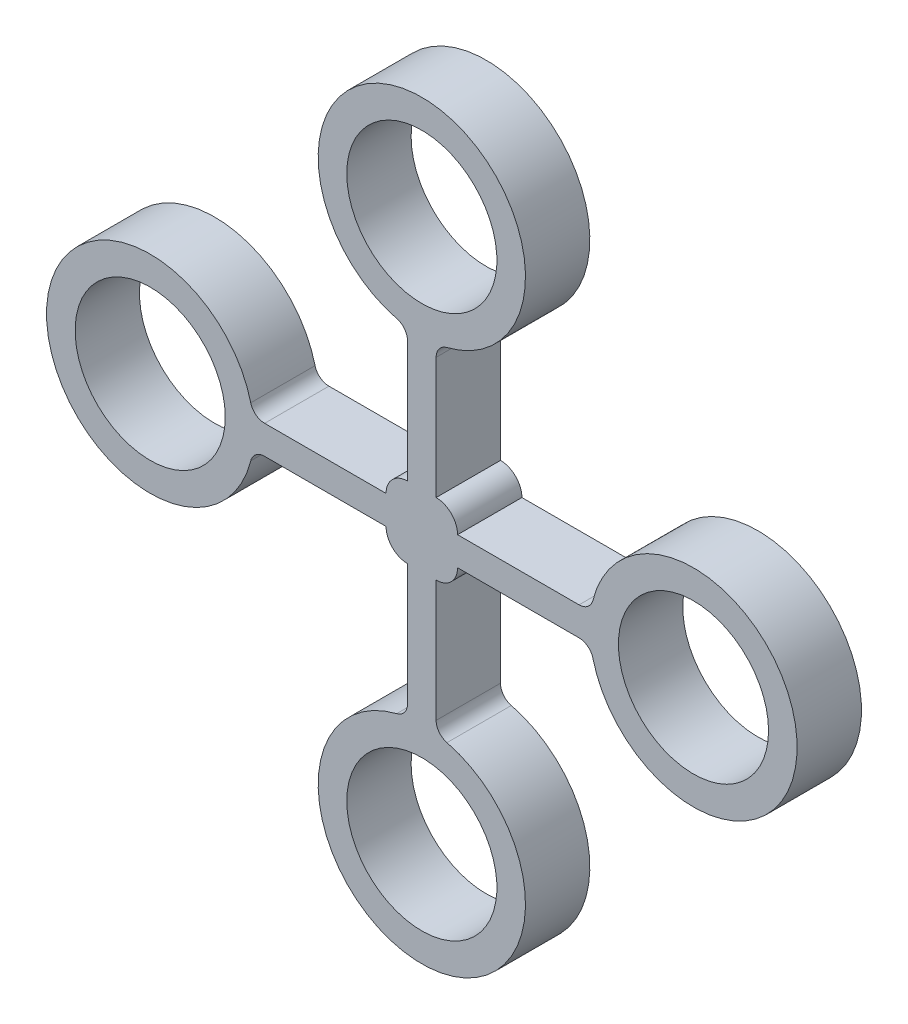
ISO-10303-21;
HEADER;
FILE_DESCRIPTION(('STEP AP214'),'2;1');
FILE_NAME('part.step','',(''),(''),'','','');
FILE_SCHEMA(('AUTOMOTIVE_DESIGN { 1 0 10303 214 1 1 1 1 }'));
ENDSEC;
DATA;
#1=APPLICATION_CONTEXT('core data for automotive mechanical design processes');
#2=APPLICATION_PROTOCOL_DEFINITION('international standard','automotive_design',2000,#1);
#3=PRODUCT_CONTEXT('',#1,'mechanical');
#4=PRODUCT('Part','Part','',(#3));
#5=PRODUCT_RELATED_PRODUCT_CATEGORY('part','',(#4));
#6=PRODUCT_DEFINITION_FORMATION('','',#4);
#7=PRODUCT_DEFINITION_CONTEXT('part definition',#1,'design');
#8=PRODUCT_DEFINITION('design','',#6,#7);
#9=PRODUCT_DEFINITION_SHAPE('','',#8);
#10=(LENGTH_UNIT() NAMED_UNIT(*) SI_UNIT(.MILLI.,.METRE.));
#11=(NAMED_UNIT(*) PLANE_ANGLE_UNIT() SI_UNIT($,.RADIAN.));
#12=(NAMED_UNIT(*) SI_UNIT($,.STERADIAN.) SOLID_ANGLE_UNIT());
#13=UNCERTAINTY_MEASURE_WITH_UNIT(LENGTH_MEASURE(1.E-05),#10,'distance_accuracy_value','');
#14=(GEOMETRIC_REPRESENTATION_CONTEXT(3) GLOBAL_UNCERTAINTY_ASSIGNED_CONTEXT((#13)) GLOBAL_UNIT_ASSIGNED_CONTEXT((#10,
#11,#12)) REPRESENTATION_CONTEXT('',''));
#15=CARTESIAN_POINT('',(0.,0.,0.));
#16=DIRECTION('',(0.,0.,1.));
#17=DIRECTION('',(1.,0.,0.));
#18=AXIS2_PLACEMENT_3D('',#15,#16,#17);
#19=CARTESIAN_POINT('',(4.,-3.99999999999998,18.));
#20=DIRECTION('',(0.,0.,1.));
#21=DIRECTION('',(1.,0.,0.));
#22=AXIS2_PLACEMENT_3D('',#19,#20,#21);
#23=PLANE('',#22);
#24=CARTESIAN_POINT('',(-76.,0.,18.));
#25=DIRECTION('',(0.,0.,1.));
#26=DIRECTION('',(1.,0.,0.));
#27=AXIS2_PLACEMENT_3D('',#24,#25,#26);
#28=CIRCLE('',#27,21.);
#29=CARTESIAN_POINT('',(-55.,0.,18.));
#30=VERTEX_POINT('',#29);
#31=EDGE_CURVE('E448',#30,#30,#28,.T.);
#32=ORIENTED_EDGE('',*,*,#31,.F.);
#33=EDGE_LOOP('',(#32));
#34=FACE_BOUND('',#33,.T.);
#35=CARTESIAN_POINT('',(76.,0.,18.));
#36=DIRECTION('',(0.,0.,1.));
#37=DIRECTION('',(1.,0.,0.));
#38=AXIS2_PLACEMENT_3D('',#35,#36,#37);
#39=CIRCLE('',#38,21.);
#40=CARTESIAN_POINT('',(97.,0.,18.));
#41=VERTEX_POINT('',#40);
#42=EDGE_CURVE('E230',#41,#41,#39,.T.);
#43=ORIENTED_EDGE('',*,*,#42,.F.);
#44=EDGE_LOOP('',(#43));
#45=FACE_BOUND('',#44,.T.);
#46=CARTESIAN_POINT('',(4.,-3.99999999999998,18.));
#47=DIRECTION('',(0.,0.,1.));
#48=DIRECTION('',(1.,0.,0.));
#49=AXIS2_PLACEMENT_3D('',#46,#47,#48);
#50=CIRCLE('',#49,6.);
#51=CARTESIAN_POINT('',(4.00000000000003,-9.99999999999998,18.));
#52=VERTEX_POINT('',#51);
#53=CARTESIAN_POINT('',(10.,-4.,18.));
#54=VERTEX_POINT('',#53);
#55=EDGE_CURVE('E273',#52,#54,#50,.T.);
#56=ORIENTED_EDGE('',*,*,#55,.T.);
#57=DIRECTION('',(1.,0.,0.));
#58=VECTOR('',#57,1.);
#59=CARTESIAN_POINT('',(10.,-4.,18.));
#60=LINE('',#59,#58);
#61=CARTESIAN_POINT('',(43.9843788128358,-4.,18.));
#62=VERTEX_POINT('',#61);
#63=EDGE_CURVE('E141',#54,#62,#60,.T.);
#64=ORIENTED_EDGE('',*,*,#63,.T.);
#65=CARTESIAN_POINT('',(43.9843788128358,-8.,18.));
#66=DIRECTION('',(0.,0.,-1.));
#67=DIRECTION('',(1.,0.,0.));
#68=AXIS2_PLACEMENT_3D('',#65,#66,#67);
#69=CIRCLE('',#68,4.);
#70=CARTESIAN_POINT('',(47.8650601688557,-7.03030303030303,18.));
#71=VERTEX_POINT('',#70);
#72=EDGE_CURVE('E336',#62,#71,#69,.T.);
#73=ORIENTED_EDGE('',*,*,#72,.T.);
#74=CARTESIAN_POINT('',(76.,0.,18.));
#75=DIRECTION('',(0.,0.,1.));
#76=DIRECTION('',(1.,0.,0.));
#77=AXIS2_PLACEMENT_3D('',#74,#75,#76);
#78=CIRCLE('',#77,29.);
#79=CARTESIAN_POINT('',(47.8650601688556,7.03030303030302,18.));
#80=VERTEX_POINT('',#79);
#81=EDGE_CURVE('E355',#71,#80,#78,.T.);
#82=ORIENTED_EDGE('',*,*,#81,.T.);
#83=CARTESIAN_POINT('',(43.9843788128358,8.,18.));
#84=DIRECTION('',(0.,0.,-1.));
#85=DIRECTION('',(-1.,0.,0.));
#86=AXIS2_PLACEMENT_3D('',#83,#84,#85);
#87=CIRCLE('',#86,4.);
#88=CARTESIAN_POINT('',(43.9843788128358,4.,18.));
#89=VERTEX_POINT('',#88);
#90=EDGE_CURVE('E352',#80,#89,#87,.T.);
#91=ORIENTED_EDGE('',*,*,#90,.T.);
#92=DIRECTION('',(-1.,0.,0.));
#93=VECTOR('',#92,1.);
#94=CARTESIAN_POINT('',(10.,4.,18.));
#95=LINE('',#94,#93);
#96=CARTESIAN_POINT('',(10.,4.,18.));
#97=VERTEX_POINT('',#96);
#98=EDGE_CURVE('E354',#89,#97,#95,.T.);
#99=ORIENTED_EDGE('',*,*,#98,.T.);
#100=CARTESIAN_POINT('',(4.,4.00000000000002,18.));
#101=DIRECTION('',(0.,0.,1.));
#102=DIRECTION('',(-1.,0.,0.));
#103=AXIS2_PLACEMENT_3D('',#100,#101,#102);
#104=CIRCLE('',#103,6.);
#105=CARTESIAN_POINT('',(3.99999999999996,10.,18.));
#106=VERTEX_POINT('',#105);
#107=EDGE_CURVE('E357',#97,#106,#104,.T.);
#108=ORIENTED_EDGE('',*,*,#107,.T.);
#109=DIRECTION('',(0.,1.,0.));
#110=VECTOR('',#109,1.);
#111=CARTESIAN_POINT('',(3.99999999999996,10.,18.));
#112=LINE('',#111,#110);
#113=CARTESIAN_POINT('',(3.99999999999983,43.9843788128358,18.));
#114=VERTEX_POINT('',#113);
#115=EDGE_CURVE('E363',#106,#114,#112,.T.);
#116=ORIENTED_EDGE('',*,*,#115,.T.);
#117=CARTESIAN_POINT('',(7.99999999999983,43.9843788128358,18.));
#118=DIRECTION('',(0.,0.,-1.));
#119=DIRECTION('',(1.,0.,0.));
#120=AXIS2_PLACEMENT_3D('',#117,#118,#119);
#121=CIRCLE('',#120,4.00000000000001);
#122=CARTESIAN_POINT('',(7.03030303030282,47.8650601688557,18.));
#123=VERTEX_POINT('',#122);
#124=EDGE_CURVE('E365',#114,#123,#121,.T.);
#125=ORIENTED_EDGE('',*,*,#124,.T.);
#126=CARTESIAN_POINT('',(-2.77555756156289E-13,76.,18.));
#127=DIRECTION('',(0.,0.,1.));
#128=DIRECTION('',(-1.,0.,0.));
#129=AXIS2_PLACEMENT_3D('',#126,#127,#128);
#130=CIRCLE('',#129,29.);
#131=CARTESIAN_POINT('',(-7.03030303030323,47.8650601688556,18.));
#132=VERTEX_POINT('',#131);
#133=EDGE_CURVE('E367',#123,#132,#130,.T.);
#134=ORIENTED_EDGE('',*,*,#133,.T.);
#135=CARTESIAN_POINT('',(-8.00000000000017,43.9843788128357,18.));
#136=DIRECTION('',(0.,0.,-1.));
#137=DIRECTION('',(-1.,0.,0.));
#138=AXIS2_PLACEMENT_3D('',#135,#136,#137);
#139=CIRCLE('',#138,3.99999999999999);
#140=CARTESIAN_POINT('',(-4.00000000000018,43.9843788128357,18.));
#141=VERTEX_POINT('',#140);
#142=EDGE_CURVE('E369',#132,#141,#139,.T.);
#143=ORIENTED_EDGE('',*,*,#142,.T.);
#144=DIRECTION('',(0.,-1.,0.));
#145=VECTOR('',#144,1.);
#146=CARTESIAN_POINT('',(-4.00000000000003,9.99999999999998,18.));
#147=LINE('',#146,#145);
#148=CARTESIAN_POINT('',(-4.00000000000003,9.99999999999998,18.));
#149=VERTEX_POINT('',#148);
#150=EDGE_CURVE('E371',#141,#149,#147,.T.);
#151=ORIENTED_EDGE('',*,*,#150,.T.);
#152=CARTESIAN_POINT('',(-4.,3.99999999999999,18.));
#153=DIRECTION('',(0.,0.,1.));
#154=DIRECTION('',(1.,0.,0.));
#155=AXIS2_PLACEMENT_3D('',#152,#153,#154);
#156=CIRCLE('',#155,6.);
#157=CARTESIAN_POINT('',(-9.99999999999999,4.,18.));
#158=VERTEX_POINT('',#157);
#159=EDGE_CURVE('E373',#149,#158,#156,.T.);
#160=ORIENTED_EDGE('',*,*,#159,.T.);
#161=DIRECTION('',(-1.,0.,0.));
#162=VECTOR('',#161,1.);
#163=CARTESIAN_POINT('',(-10.,4.,18.));
#164=LINE('',#163,#162);
#165=CARTESIAN_POINT('',(-43.9843788128358,3.99999999999996,18.));
#166=VERTEX_POINT('',#165);
#167=EDGE_CURVE('E375',#158,#166,#164,.T.);
#168=ORIENTED_EDGE('',*,*,#167,.T.);
#169=CARTESIAN_POINT('',(-43.9843788128358,7.99999999999996,18.));
#170=DIRECTION('',(0.,0.,-1.));
#171=DIRECTION('',(1.,0.,0.));
#172=AXIS2_PLACEMENT_3D('',#169,#170,#171);
#173=CIRCLE('',#172,3.99999999999998);
#174=CARTESIAN_POINT('',(-47.8650601688557,7.03030303030303,18.));
#175=VERTEX_POINT('',#174);
#176=EDGE_CURVE('E377',#166,#175,#173,.T.);
#177=ORIENTED_EDGE('',*,*,#176,.T.);
#178=CARTESIAN_POINT('',(-76.,0.,18.));
#179=DIRECTION('',(0.,0.,1.));
#180=DIRECTION('',(1.,0.,0.));
#181=AXIS2_PLACEMENT_3D('',#178,#179,#180);
#182=CIRCLE('',#181,29.);
#183=CARTESIAN_POINT('',(-47.8650601688557,-7.03030303030303,18.));
#184=VERTEX_POINT('',#183);
#185=EDGE_CURVE('E379',#175,#184,#182,.T.);
#186=ORIENTED_EDGE('',*,*,#185,.T.);
#187=CARTESIAN_POINT('',(-43.9843788128358,-8.00000000000004,18.));
#188=DIRECTION('',(0.,0.,-1.));
#189=DIRECTION('',(-1.,0.,0.));
#190=AXIS2_PLACEMENT_3D('',#187,#188,#189);
#191=CIRCLE('',#190,4.00000000000001);
#192=CARTESIAN_POINT('',(-43.9843788128358,-4.00000000000003,18.));
#193=VERTEX_POINT('',#192);
#194=EDGE_CURVE('E381',#184,#193,#191,.T.);
#195=ORIENTED_EDGE('',*,*,#194,.T.);
#196=DIRECTION('',(1.,0.,0.));
#197=VECTOR('',#196,1.);
#198=CARTESIAN_POINT('',(-9.99999999999997,-4.,18.));
#199=LINE('',#198,#197);
#200=CARTESIAN_POINT('',(-9.99999999999997,-4.,18.));
#201=VERTEX_POINT('',#200);
#202=EDGE_CURVE('E383',#193,#201,#199,.T.);
#203=ORIENTED_EDGE('',*,*,#202,.T.);
#204=CARTESIAN_POINT('',(-3.99999999999997,-3.99999999999998,18.));
#205=DIRECTION('',(0.,0.,1.));
#206=DIRECTION('',(1.,0.,0.));
#207=AXIS2_PLACEMENT_3D('',#204,#205,#206);
#208=CIRCLE('',#207,6.);
#209=CARTESIAN_POINT('',(-3.99999999999996,-9.99999999999998,18.));
#210=VERTEX_POINT('',#209);
#211=EDGE_CURVE('E385',#201,#210,#208,.T.);
#212=ORIENTED_EDGE('',*,*,#211,.T.);
#213=DIRECTION('',(0.,-1.,0.));
#214=VECTOR('',#213,1.);
#215=CARTESIAN_POINT('',(-3.99999999999996,-9.99999999999998,18.));
#216=LINE('',#215,#214);
#217=CARTESIAN_POINT('',(-3.99999999999982,-43.9843788128358,18.));
#218=VERTEX_POINT('',#217);
#219=EDGE_CURVE('E387',#210,#218,#216,.T.);
#220=ORIENTED_EDGE('',*,*,#219,.T.);
#221=CARTESIAN_POINT('',(-7.99999999999983,-43.9843788128358,18.));
#222=DIRECTION('',(0.,0.,-1.));
#223=DIRECTION('',(1.,0.,0.));
#224=AXIS2_PLACEMENT_3D('',#221,#222,#223);
#225=CIRCLE('',#224,4.);
#226=CARTESIAN_POINT('',(-7.03030303030283,-47.8650601688557,18.));
#227=VERTEX_POINT('',#226);
#228=EDGE_CURVE('E208',#218,#227,#225,.T.);
#229=ORIENTED_EDGE('',*,*,#228,.T.);
#230=CARTESIAN_POINT('',(3.05311331771918E-13,-76.,18.));
#231=DIRECTION('',(0.,0.,1.));
#232=DIRECTION('',(-1.,0.,0.));
#233=AXIS2_PLACEMENT_3D('',#230,#231,#232);
#234=CIRCLE('',#233,29.);
#235=CARTESIAN_POINT('',(7.03030303030323,-47.8650601688556,18.));
#236=VERTEX_POINT('',#235);
#237=EDGE_CURVE('E202',#227,#236,#234,.T.);
#238=ORIENTED_EDGE('',*,*,#237,.T.);
#239=CARTESIAN_POINT('',(8.00000000000018,-43.9843788128357,18.));
#240=DIRECTION('',(0.,0.,-1.));
#241=DIRECTION('',(-1.,0.,0.));
#242=AXIS2_PLACEMENT_3D('',#239,#240,#241);
#243=CIRCLE('',#242,4.00000000000001);
#244=CARTESIAN_POINT('',(4.00000000000017,-43.9843788128358,18.));
#245=VERTEX_POINT('',#244);
#246=EDGE_CURVE('E206',#236,#245,#243,.T.);
#247=ORIENTED_EDGE('',*,*,#246,.T.);
#248=DIRECTION('',(0.,1.,0.));
#249=VECTOR('',#248,1.);
#250=CARTESIAN_POINT('',(4.00000000000003,-9.99999999999998,18.));
#251=LINE('',#250,#249);
#252=EDGE_CURVE('E50',#245,#52,#251,.T.);
#253=ORIENTED_EDGE('',*,*,#252,.T.);
#254=EDGE_LOOP('',(#56,#64,#73,#82,#91,#99,#108,#116,#125,#134,#143,#151,#160,#168,#177,#186,
#195,#203,#212,#220,#229,#238,#247,#253));
#255=FACE_BOUND('',#254,.T.);
#256=CARTESIAN_POINT('',(3.05311331771918E-13,-76.,18.));
#257=DIRECTION('',(0.,0.,1.));
#258=DIRECTION('',(-1.,0.,0.));
#259=AXIS2_PLACEMENT_3D('',#256,#257,#258);
#260=CIRCLE('',#259,21.);
#261=CARTESIAN_POINT('',(-20.9999999999997,-76.,18.));
#262=VERTEX_POINT('',#261);
#263=EDGE_CURVE('E454',#262,#262,#260,.T.);
#264=ORIENTED_EDGE('',*,*,#263,.F.);
#265=EDGE_LOOP('',(#264));
#266=FACE_BOUND('',#265,.T.);
#267=CARTESIAN_POINT('',(-2.77555756156289E-13,76.,18.));
#268=DIRECTION('',(0.,0.,1.));
#269=DIRECTION('',(-1.,0.,0.));
#270=AXIS2_PLACEMENT_3D('',#267,#268,#269);
#271=CIRCLE('',#270,21.);
#272=CARTESIAN_POINT('',(-21.0000000000003,76.,18.));
#273=VERTEX_POINT('',#272);
#274=EDGE_CURVE('E439',#273,#273,#271,.T.);
#275=ORIENTED_EDGE('',*,*,#274,.F.);
#276=EDGE_LOOP('',(#275));
#277=FACE_BOUND('',#276,.T.);
#278=ADVANCED_FACE('F33',(#34,#45,#255,#266,#277),#23,.T.);
#279=CARTESIAN_POINT('',(4.,-3.99999999999998,0.));
#280=DIRECTION('',(0.,0.,1.));
#281=DIRECTION('',(1.,0.,0.));
#282=AXIS2_PLACEMENT_3D('',#279,#280,#281);
#283=PLANE('',#282);
#284=CARTESIAN_POINT('',(-76.,0.,0.));
#285=DIRECTION('',(0.,0.,1.));
#286=DIRECTION('',(1.,0.,0.));
#287=AXIS2_PLACEMENT_3D('',#284,#285,#286);
#288=CIRCLE('',#287,21.);
#289=CARTESIAN_POINT('',(-55.,0.,0.));
#290=VERTEX_POINT('',#289);
#291=EDGE_CURVE('E445',#290,#290,#288,.T.);
#292=ORIENTED_EDGE('',*,*,#291,.T.);
#293=EDGE_LOOP('',(#292));
#294=FACE_BOUND('',#293,.T.);
#295=CARTESIAN_POINT('',(76.,0.,0.));
#296=DIRECTION('',(0.,0.,1.));
#297=DIRECTION('',(1.,0.,0.));
#298=AXIS2_PLACEMENT_3D('',#295,#296,#297);
#299=CIRCLE('',#298,21.);
#300=CARTESIAN_POINT('',(97.,0.,0.));
#301=VERTEX_POINT('',#300);
#302=EDGE_CURVE('E457',#301,#301,#299,.T.);
#303=ORIENTED_EDGE('',*,*,#302,.T.);
#304=EDGE_LOOP('',(#303));
#305=FACE_BOUND('',#304,.T.);
#306=CARTESIAN_POINT('',(4.,-3.99999999999998,0.));
#307=DIRECTION('',(0.,0.,1.));
#308=DIRECTION('',(1.,0.,0.));
#309=AXIS2_PLACEMENT_3D('',#306,#307,#308);
#310=CIRCLE('',#309,6.);
#311=CARTESIAN_POINT('',(4.00000000000003,-9.99999999999998,0.));
#312=VERTEX_POINT('',#311);
#313=CARTESIAN_POINT('',(10.,-4.,0.));
#314=VERTEX_POINT('',#313);
#315=EDGE_CURVE('E226',#312,#314,#310,.T.);
#316=ORIENTED_EDGE('',*,*,#315,.F.);
#317=DIRECTION('',(0.,1.,0.));
#318=VECTOR('',#317,1.);
#319=CARTESIAN_POINT('',(4.00000000000003,-9.99999999999998,0.));
#320=LINE('',#319,#318);
#321=CARTESIAN_POINT('',(4.00000000000017,-43.9843788128358,0.));
#322=VERTEX_POINT('',#321);
#323=EDGE_CURVE('E133',#322,#312,#320,.T.);
#324=ORIENTED_EDGE('',*,*,#323,.F.);
#325=CARTESIAN_POINT('',(8.00000000000018,-43.9843788128357,0.));
#326=DIRECTION('',(0.,0.,-1.));
#327=DIRECTION('',(-1.,0.,0.));
#328=AXIS2_PLACEMENT_3D('',#325,#326,#327);
#329=CIRCLE('',#328,4.00000000000001);
#330=CARTESIAN_POINT('',(7.03030303030323,-47.8650601688556,0.));
#331=VERTEX_POINT('',#330);
#332=EDGE_CURVE('E127',#331,#322,#329,.T.);
#333=ORIENTED_EDGE('',*,*,#332,.F.);
#334=CARTESIAN_POINT('',(3.05311331771918E-13,-76.,0.));
#335=DIRECTION('',(0.,0.,1.));
#336=DIRECTION('',(-1.,0.,0.));
#337=AXIS2_PLACEMENT_3D('',#334,#335,#336);
#338=CIRCLE('',#337,29.);
#339=CARTESIAN_POINT('',(-7.03030303030283,-47.8650601688557,0.));
#340=VERTEX_POINT('',#339);
#341=EDGE_CURVE('E216',#340,#331,#338,.T.);
#342=ORIENTED_EDGE('',*,*,#341,.F.);
#343=CARTESIAN_POINT('',(-7.99999999999983,-43.9843788128358,0.));
#344=DIRECTION('',(0.,0.,-1.));
#345=DIRECTION('',(1.,0.,0.));
#346=AXIS2_PLACEMENT_3D('',#343,#344,#345);
#347=CIRCLE('',#346,4.);
#348=CARTESIAN_POINT('',(-3.99999999999982,-43.9843788128358,0.));
#349=VERTEX_POINT('',#348);
#350=EDGE_CURVE('E268',#349,#340,#347,.T.);
#351=ORIENTED_EDGE('',*,*,#350,.F.);
#352=DIRECTION('',(0.,-1.,0.));
#353=VECTOR('',#352,1.);
#354=CARTESIAN_POINT('',(-3.99999999999996,-9.99999999999998,0.));
#355=LINE('',#354,#353);
#356=CARTESIAN_POINT('',(-3.99999999999996,-9.99999999999998,0.));
#357=VERTEX_POINT('',#356);
#358=EDGE_CURVE('E266',#357,#349,#355,.T.);
#359=ORIENTED_EDGE('',*,*,#358,.F.);
#360=CARTESIAN_POINT('',(-3.99999999999997,-3.99999999999998,0.));
#361=DIRECTION('',(0.,0.,1.));
#362=DIRECTION('',(1.,0.,0.));
#363=AXIS2_PLACEMENT_3D('',#360,#361,#362);
#364=CIRCLE('',#363,6.);
#365=CARTESIAN_POINT('',(-9.99999999999997,-4.,0.));
#366=VERTEX_POINT('',#365);
#367=EDGE_CURVE('E264',#366,#357,#364,.T.);
#368=ORIENTED_EDGE('',*,*,#367,.F.);
#369=DIRECTION('',(1.,0.,0.));
#370=VECTOR('',#369,1.);
#371=CARTESIAN_POINT('',(-9.99999999999997,-4.,0.));
#372=LINE('',#371,#370);
#373=CARTESIAN_POINT('',(-43.9843788128358,-4.00000000000003,0.));
#374=VERTEX_POINT('',#373);
#375=EDGE_CURVE('E262',#374,#366,#372,.T.);
#376=ORIENTED_EDGE('',*,*,#375,.F.);
#377=CARTESIAN_POINT('',(-43.9843788128358,-8.00000000000004,0.));
#378=DIRECTION('',(0.,0.,-1.));
#379=DIRECTION('',(-1.,0.,0.));
#380=AXIS2_PLACEMENT_3D('',#377,#378,#379);
#381=CIRCLE('',#380,4.00000000000001);
#382=CARTESIAN_POINT('',(-47.8650601688557,-7.03030303030303,0.));
#383=VERTEX_POINT('',#382);
#384=EDGE_CURVE('E260',#383,#374,#381,.T.);
#385=ORIENTED_EDGE('',*,*,#384,.F.);
#386=CARTESIAN_POINT('',(-76.,0.,0.));
#387=DIRECTION('',(0.,0.,1.));
#388=DIRECTION('',(1.,0.,0.));
#389=AXIS2_PLACEMENT_3D('',#386,#387,#388);
#390=CIRCLE('',#389,29.);
#391=CARTESIAN_POINT('',(-47.8650601688557,7.03030303030303,0.));
#392=VERTEX_POINT('',#391);
#393=EDGE_CURVE('E258',#392,#383,#390,.T.);
#394=ORIENTED_EDGE('',*,*,#393,.F.);
#395=CARTESIAN_POINT('',(-43.9843788128358,7.99999999999996,0.));
#396=DIRECTION('',(0.,0.,-1.));
#397=DIRECTION('',(1.,0.,0.));
#398=AXIS2_PLACEMENT_3D('',#395,#396,#397);
#399=CIRCLE('',#398,3.99999999999998);
#400=CARTESIAN_POINT('',(-43.9843788128358,3.99999999999996,0.));
#401=VERTEX_POINT('',#400);
#402=EDGE_CURVE('E256',#401,#392,#399,.T.);
#403=ORIENTED_EDGE('',*,*,#402,.F.);
#404=DIRECTION('',(-1.,0.,0.));
#405=VECTOR('',#404,1.);
#406=CARTESIAN_POINT('',(-10.,4.,0.));
#407=LINE('',#406,#405);
#408=CARTESIAN_POINT('',(-9.99999999999999,4.,0.));
#409=VERTEX_POINT('',#408);
#410=EDGE_CURVE('E254',#409,#401,#407,.T.);
#411=ORIENTED_EDGE('',*,*,#410,.F.);
#412=CARTESIAN_POINT('',(-4.,3.99999999999999,0.));
#413=DIRECTION('',(0.,0.,1.));
#414=DIRECTION('',(1.,0.,0.));
#415=AXIS2_PLACEMENT_3D('',#412,#413,#414);
#416=CIRCLE('',#415,6.);
#417=CARTESIAN_POINT('',(-4.00000000000003,9.99999999999998,0.));
#418=VERTEX_POINT('',#417);
#419=EDGE_CURVE('E252',#418,#409,#416,.T.);
#420=ORIENTED_EDGE('',*,*,#419,.F.);
#421=DIRECTION('',(0.,-1.,0.));
#422=VECTOR('',#421,1.);
#423=CARTESIAN_POINT('',(-4.00000000000003,9.99999999999998,0.));
#424=LINE('',#423,#422);
#425=CARTESIAN_POINT('',(-4.00000000000018,43.9843788128357,0.));
#426=VERTEX_POINT('',#425);
#427=EDGE_CURVE('E250',#426,#418,#424,.T.);
#428=ORIENTED_EDGE('',*,*,#427,.F.);
#429=CARTESIAN_POINT('',(-8.00000000000017,43.9843788128357,0.));
#430=DIRECTION('',(0.,0.,-1.));
#431=DIRECTION('',(-1.,0.,0.));
#432=AXIS2_PLACEMENT_3D('',#429,#430,#431);
#433=CIRCLE('',#432,3.99999999999999);
#434=CARTESIAN_POINT('',(-7.03030303030323,47.8650601688556,0.));
#435=VERTEX_POINT('',#434);
#436=EDGE_CURVE('E248',#435,#426,#433,.T.);
#437=ORIENTED_EDGE('',*,*,#436,.F.);
#438=CARTESIAN_POINT('',(-2.77555756156289E-13,76.,0.));
#439=DIRECTION('',(0.,0.,1.));
#440=DIRECTION('',(-1.,0.,0.));
#441=AXIS2_PLACEMENT_3D('',#438,#439,#440);
#442=CIRCLE('',#441,29.);
#443=CARTESIAN_POINT('',(7.03030303030282,47.8650601688557,0.));
#444=VERTEX_POINT('',#443);
#445=EDGE_CURVE('E246',#444,#435,#442,.T.);
#446=ORIENTED_EDGE('',*,*,#445,.F.);
#447=CARTESIAN_POINT('',(7.99999999999983,43.9843788128358,0.));
#448=DIRECTION('',(0.,0.,-1.));
#449=DIRECTION('',(1.,0.,0.));
#450=AXIS2_PLACEMENT_3D('',#447,#448,#449);
#451=CIRCLE('',#450,4.00000000000001);
#452=CARTESIAN_POINT('',(3.99999999999983,43.9843788128358,0.));
#453=VERTEX_POINT('',#452);
#454=EDGE_CURVE('E244',#453,#444,#451,.T.);
#455=ORIENTED_EDGE('',*,*,#454,.F.);
#456=DIRECTION('',(0.,1.,0.));
#457=VECTOR('',#456,1.);
#458=CARTESIAN_POINT('',(3.99999999999996,10.,0.));
#459=LINE('',#458,#457);
#460=CARTESIAN_POINT('',(3.99999999999996,10.,0.));
#461=VERTEX_POINT('',#460);
#462=EDGE_CURVE('E242',#461,#453,#459,.T.);
#463=ORIENTED_EDGE('',*,*,#462,.F.);
#464=CARTESIAN_POINT('',(4.,4.00000000000002,0.));
#465=DIRECTION('',(0.,0.,1.));
#466=DIRECTION('',(-1.,0.,0.));
#467=AXIS2_PLACEMENT_3D('',#464,#465,#466);
#468=CIRCLE('',#467,6.);
#469=CARTESIAN_POINT('',(10.,4.,0.));
#470=VERTEX_POINT('',#469);
#471=EDGE_CURVE('E240',#470,#461,#468,.T.);
#472=ORIENTED_EDGE('',*,*,#471,.F.);
#473=DIRECTION('',(-1.,0.,0.));
#474=VECTOR('',#473,1.);
#475=CARTESIAN_POINT('',(10.,4.,0.));
#476=LINE('',#475,#474);
#477=CARTESIAN_POINT('',(43.9843788128358,4.,0.));
#478=VERTEX_POINT('',#477);
#479=EDGE_CURVE('E238',#478,#470,#476,.T.);
#480=ORIENTED_EDGE('',*,*,#479,.F.);
#481=CARTESIAN_POINT('',(43.9843788128358,8.,0.));
#482=DIRECTION('',(0.,0.,-1.));
#483=DIRECTION('',(-1.,0.,0.));
#484=AXIS2_PLACEMENT_3D('',#481,#482,#483);
#485=CIRCLE('',#484,4.);
#486=CARTESIAN_POINT('',(47.8650601688556,7.03030303030302,0.));
#487=VERTEX_POINT('',#486);
#488=EDGE_CURVE('E236',#487,#478,#485,.T.);
#489=ORIENTED_EDGE('',*,*,#488,.F.);
#490=CARTESIAN_POINT('',(76.,0.,0.));
#491=DIRECTION('',(0.,0.,1.));
#492=DIRECTION('',(1.,0.,0.));
#493=AXIS2_PLACEMENT_3D('',#490,#491,#492);
#494=CIRCLE('',#493,29.);
#495=CARTESIAN_POINT('',(47.8650601688557,-7.03030303030303,0.));
#496=VERTEX_POINT('',#495);
#497=EDGE_CURVE('E234',#496,#487,#494,.T.);
#498=ORIENTED_EDGE('',*,*,#497,.F.);
#499=CARTESIAN_POINT('',(43.9843788128358,-8.,0.));
#500=DIRECTION('',(0.,0.,-1.));
#501=DIRECTION('',(1.,0.,0.));
#502=AXIS2_PLACEMENT_3D('',#499,#500,#501);
#503=CIRCLE('',#502,4.);
#504=CARTESIAN_POINT('',(43.9843788128358,-4.,0.));
#505=VERTEX_POINT('',#504);
#506=EDGE_CURVE('E232',#505,#496,#503,.T.);
#507=ORIENTED_EDGE('',*,*,#506,.F.);
#508=DIRECTION('',(1.,0.,0.));
#509=VECTOR('',#508,1.);
#510=CARTESIAN_POINT('',(10.,-4.,0.));
#511=LINE('',#510,#509);
#512=EDGE_CURVE('E229',#314,#505,#511,.T.);
#513=ORIENTED_EDGE('',*,*,#512,.F.);
#514=EDGE_LOOP('',(#316,#324,#333,#342,#351,#359,#368,#376,#385,#394,#403,#411,#420,#428,#437,
#446,#455,#463,#472,#480,#489,#498,#507,#513));
#515=FACE_BOUND('',#514,.T.);
#516=CARTESIAN_POINT('',(3.05311331771918E-13,-76.,0.));
#517=DIRECTION('',(0.,0.,1.));
#518=DIRECTION('',(-1.,0.,0.));
#519=AXIS2_PLACEMENT_3D('',#516,#517,#518);
#520=CIRCLE('',#519,21.);
#521=CARTESIAN_POINT('',(-20.9999999999997,-76.,0.));
#522=VERTEX_POINT('',#521);
#523=EDGE_CURVE('E451',#522,#522,#520,.T.);
#524=ORIENTED_EDGE('',*,*,#523,.T.);
#525=EDGE_LOOP('',(#524));
#526=FACE_BOUND('',#525,.T.);
#527=CARTESIAN_POINT('',(-2.77555756156289E-13,76.,0.));
#528=DIRECTION('',(0.,0.,1.));
#529=DIRECTION('',(-1.,0.,0.));
#530=AXIS2_PLACEMENT_3D('',#527,#528,#529);
#531=CIRCLE('',#530,21.);
#532=CARTESIAN_POINT('',(-21.0000000000003,76.,0.));
#533=VERTEX_POINT('',#532);
#534=EDGE_CURVE('E442',#533,#533,#531,.T.);
#535=ORIENTED_EDGE('',*,*,#534,.T.);
#536=EDGE_LOOP('',(#535));
#537=FACE_BOUND('',#536,.T.);
#538=ADVANCED_FACE('F340',(#294,#305,#515,#526,#537),#283,.F.);
#539=CARTESIAN_POINT('',(4.,-3.99999999999998,18.));
#540=DIRECTION('',(0.,0.,-1.));
#541=DIRECTION('',(-1.,0.,0.));
#542=AXIS2_PLACEMENT_3D('',#539,#540,#541);
#543=CYLINDRICAL_SURFACE('',#542,6.);
#544=ORIENTED_EDGE('',*,*,#315,.T.);
#545=DIRECTION('',(0.,0.,-1.));
#546=VECTOR('',#545,1.);
#547=CARTESIAN_POINT('',(10.,-4.,18.));
#548=LINE('',#547,#546);
#549=EDGE_CURVE('E11',#54,#314,#548,.T.);
#550=ORIENTED_EDGE('',*,*,#549,.F.);
#551=ORIENTED_EDGE('',*,*,#55,.F.);
#552=DIRECTION('',(0.,0.,-1.));
#553=VECTOR('',#552,1.);
#554=CARTESIAN_POINT('',(4.00000000000003,-9.99999999999998,18.));
#555=LINE('',#554,#553);
#556=EDGE_CURVE('E222',#52,#312,#555,.T.);
#557=ORIENTED_EDGE('',*,*,#556,.T.);
#558=EDGE_LOOP('',(#544,#550,#551,#557));
#559=FACE_BOUND('',#558,.T.);
#560=ADVANCED_FACE('F35',(#559),#543,.T.);
#561=CARTESIAN_POINT('',(10.,-4.,18.));
#562=DIRECTION('',(0.,1.,0.));
#563=DIRECTION('',(0.,0.,1.));
#564=AXIS2_PLACEMENT_3D('',#561,#562,#563);
#565=PLANE('',#564);
#566=ORIENTED_EDGE('',*,*,#512,.T.);
#567=DIRECTION('',(0.,0.,-1.));
#568=VECTOR('',#567,1.);
#569=CARTESIAN_POINT('',(43.9843788128358,-4.,18.));
#570=LINE('',#569,#568);
#571=EDGE_CURVE('E42',#62,#505,#570,.T.);
#572=ORIENTED_EDGE('',*,*,#571,.F.);
#573=ORIENTED_EDGE('',*,*,#63,.F.);
#574=ORIENTED_EDGE('',*,*,#549,.T.);
#575=EDGE_LOOP('',(#566,#572,#573,#574));
#576=FACE_BOUND('',#575,.T.);
#577=ADVANCED_FACE('F686',(#576),#565,.F.);
#578=CARTESIAN_POINT('',(43.9843788128358,-8.,18.));
#579=DIRECTION('',(0.,0.,-1.));
#580=DIRECTION('',(-1.,0.,0.));
#581=AXIS2_PLACEMENT_3D('',#578,#579,#580);
#582=CYLINDRICAL_SURFACE('',#581,4.);
#583=ORIENTED_EDGE('',*,*,#506,.T.);
#584=DIRECTION('',(0.,0.,-1.));
#585=VECTOR('',#584,1.);
#586=CARTESIAN_POINT('',(47.8650601688557,-7.03030303030303,18.));
#587=LINE('',#586,#585);
#588=EDGE_CURVE('E328',#71,#496,#587,.T.);
#589=ORIENTED_EDGE('',*,*,#588,.F.);
#590=ORIENTED_EDGE('',*,*,#72,.F.);
#591=ORIENTED_EDGE('',*,*,#571,.T.);
#592=EDGE_LOOP('',(#583,#589,#590,#591));
#593=FACE_BOUND('',#592,.T.);
#594=ADVANCED_FACE('F334',(#593),#582,.F.);
#595=CARTESIAN_POINT('',(76.,0.,18.));
#596=DIRECTION('',(0.,0.,-1.));
#597=DIRECTION('',(-1.,0.,0.));
#598=AXIS2_PLACEMENT_3D('',#595,#596,#597);
#599=CYLINDRICAL_SURFACE('',#598,29.);
#600=ORIENTED_EDGE('',*,*,#497,.T.);
#601=DIRECTION('',(0.,0.,-1.));
#602=VECTOR('',#601,1.);
#603=CARTESIAN_POINT('',(47.8650601688556,7.03030303030302,18.));
#604=LINE('',#603,#602);
#605=EDGE_CURVE('E325',#80,#487,#604,.T.);
#606=ORIENTED_EDGE('',*,*,#605,.F.);
#607=ORIENTED_EDGE('',*,*,#81,.F.);
#608=ORIENTED_EDGE('',*,*,#588,.T.);
#609=EDGE_LOOP('',(#600,#606,#607,#608));
#610=FACE_BOUND('',#609,.T.);
#611=ADVANCED_FACE('F346',(#610),#599,.T.);
#612=CARTESIAN_POINT('',(43.9843788128358,8.,18.));
#613=DIRECTION('',(0.,0.,-1.));
#614=DIRECTION('',(-1.,0.,0.));
#615=AXIS2_PLACEMENT_3D('',#612,#613,#614);
#616=CYLINDRICAL_SURFACE('',#615,4.);
#617=ORIENTED_EDGE('',*,*,#488,.T.);
#618=DIRECTION('',(0.,0.,-1.));
#619=VECTOR('',#618,1.);
#620=CARTESIAN_POINT('',(43.9843788128358,4.,18.));
#621=LINE('',#620,#619);
#622=EDGE_CURVE('E322',#89,#478,#621,.T.);
#623=ORIENTED_EDGE('',*,*,#622,.F.);
#624=ORIENTED_EDGE('',*,*,#90,.F.);
#625=ORIENTED_EDGE('',*,*,#605,.T.);
#626=EDGE_LOOP('',(#617,#623,#624,#625));
#627=FACE_BOUND('',#626,.T.);
#628=ADVANCED_FACE('F350',(#627),#616,.F.);
#629=CARTESIAN_POINT('',(10.,4.,18.));
#630=DIRECTION('',(0.,-1.,0.));
#631=DIRECTION('',(0.,0.,-1.));
#632=AXIS2_PLACEMENT_3D('',#629,#630,#631);
#633=PLANE('',#632);
#634=ORIENTED_EDGE('',*,*,#479,.T.);
#635=DIRECTION('',(0.,0.,-1.));
#636=VECTOR('',#635,1.);
#637=CARTESIAN_POINT('',(10.,4.,18.));
#638=LINE('',#637,#636);
#639=EDGE_CURVE('E319',#97,#470,#638,.T.);
#640=ORIENTED_EDGE('',*,*,#639,.F.);
#641=ORIENTED_EDGE('',*,*,#98,.F.);
#642=ORIENTED_EDGE('',*,*,#622,.T.);
#643=EDGE_LOOP('',(#634,#640,#641,#642));
#644=FACE_BOUND('',#643,.T.);
#645=ADVANCED_FACE('F651',(#644),#633,.F.);
#646=CARTESIAN_POINT('',(4.,4.00000000000002,18.));
#647=DIRECTION('',(0.,0.,-1.));
#648=DIRECTION('',(-1.,0.,0.));
#649=AXIS2_PLACEMENT_3D('',#646,#647,#648);
#650=CYLINDRICAL_SURFACE('',#649,6.);
#651=ORIENTED_EDGE('',*,*,#471,.T.);
#652=DIRECTION('',(0.,0.,-1.));
#653=VECTOR('',#652,1.);
#654=CARTESIAN_POINT('',(3.99999999999996,10.,18.));
#655=LINE('',#654,#653);
#656=EDGE_CURVE('E316',#106,#461,#655,.T.);
#657=ORIENTED_EDGE('',*,*,#656,.F.);
#658=ORIENTED_EDGE('',*,*,#107,.F.);
#659=ORIENTED_EDGE('',*,*,#639,.T.);
#660=EDGE_LOOP('',(#651,#657,#658,#659));
#661=FACE_BOUND('',#660,.T.);
#662=ADVANCED_FACE('F641',(#661),#650,.T.);
#663=CARTESIAN_POINT('',(3.99999999999996,10.,18.));
#664=DIRECTION('',(-1.,0.,0.));
#665=DIRECTION('',(0.,-1.,0.));
#666=AXIS2_PLACEMENT_3D('',#663,#664,#665);
#667=PLANE('',#666);
#668=ORIENTED_EDGE('',*,*,#462,.T.);
#669=DIRECTION('',(0.,0.,-1.));
#670=VECTOR('',#669,1.);
#671=CARTESIAN_POINT('',(3.99999999999983,43.9843788128358,18.));
#672=LINE('',#671,#670);
#673=EDGE_CURVE('E313',#114,#453,#672,.T.);
#674=ORIENTED_EDGE('',*,*,#673,.F.);
#675=ORIENTED_EDGE('',*,*,#115,.F.);
#676=ORIENTED_EDGE('',*,*,#656,.T.);
#677=EDGE_LOOP('',(#668,#674,#675,#676));
#678=FACE_BOUND('',#677,.T.);
#679=ADVANCED_FACE('F631',(#678),#667,.F.);
#680=CARTESIAN_POINT('',(7.99999999999983,43.9843788128358,18.));
#681=DIRECTION('',(0.,0.,-1.));
#682=DIRECTION('',(-1.,0.,0.));
#683=AXIS2_PLACEMENT_3D('',#680,#681,#682);
#684=CYLINDRICAL_SURFACE('',#683,4.00000000000001);
#685=ORIENTED_EDGE('',*,*,#454,.T.);
#686=DIRECTION('',(0.,0.,-1.));
#687=VECTOR('',#686,1.);
#688=CARTESIAN_POINT('',(7.03030303030282,47.8650601688557,18.));
#689=LINE('',#688,#687);
#690=EDGE_CURVE('E310',#123,#444,#689,.T.);
#691=ORIENTED_EDGE('',*,*,#690,.F.);
#692=ORIENTED_EDGE('',*,*,#124,.F.);
#693=ORIENTED_EDGE('',*,*,#673,.T.);
#694=EDGE_LOOP('',(#685,#691,#692,#693));
#695=FACE_BOUND('',#694,.T.);
#696=ADVANCED_FACE('F621',(#695),#684,.F.);
#697=CARTESIAN_POINT('',(-2.77555756156289E-13,76.,18.));
#698=DIRECTION('',(0.,0.,-1.));
#699=DIRECTION('',(-1.,0.,0.));
#700=AXIS2_PLACEMENT_3D('',#697,#698,#699);
#701=CYLINDRICAL_SURFACE('',#700,29.);
#702=ORIENTED_EDGE('',*,*,#445,.T.);
#703=DIRECTION('',(0.,0.,-1.));
#704=VECTOR('',#703,1.);
#705=CARTESIAN_POINT('',(-7.03030303030323,47.8650601688556,18.));
#706=LINE('',#705,#704);
#707=EDGE_CURVE('E307',#132,#435,#706,.T.);
#708=ORIENTED_EDGE('',*,*,#707,.F.);
#709=ORIENTED_EDGE('',*,*,#133,.F.);
#710=ORIENTED_EDGE('',*,*,#690,.T.);
#711=EDGE_LOOP('',(#702,#708,#709,#710));
#712=FACE_BOUND('',#711,.T.);
#713=ADVANCED_FACE('F611',(#712),#701,.T.);
#714=CARTESIAN_POINT('',(-8.00000000000017,43.9843788128357,18.));
#715=DIRECTION('',(0.,0.,-1.));
#716=DIRECTION('',(-1.,0.,0.));
#717=AXIS2_PLACEMENT_3D('',#714,#715,#716);
#718=CYLINDRICAL_SURFACE('',#717,3.99999999999999);
#719=ORIENTED_EDGE('',*,*,#436,.T.);
#720=DIRECTION('',(0.,0.,-1.));
#721=VECTOR('',#720,1.);
#722=CARTESIAN_POINT('',(-4.00000000000018,43.9843788128357,18.));
#723=LINE('',#722,#721);
#724=EDGE_CURVE('E304',#141,#426,#723,.T.);
#725=ORIENTED_EDGE('',*,*,#724,.F.);
#726=ORIENTED_EDGE('',*,*,#142,.F.);
#727=ORIENTED_EDGE('',*,*,#707,.T.);
#728=EDGE_LOOP('',(#719,#725,#726,#727));
#729=FACE_BOUND('',#728,.T.);
#730=ADVANCED_FACE('F601',(#729),#718,.F.);
#731=CARTESIAN_POINT('',(-4.00000000000003,9.99999999999998,18.));
#732=DIRECTION('',(1.,0.,0.));
#733=DIRECTION('',(0.,1.,0.));
#734=AXIS2_PLACEMENT_3D('',#731,#732,#733);
#735=PLANE('',#734);
#736=ORIENTED_EDGE('',*,*,#427,.T.);
#737=DIRECTION('',(0.,0.,-1.));
#738=VECTOR('',#737,1.);
#739=CARTESIAN_POINT('',(-4.00000000000003,9.99999999999998,18.));
#740=LINE('',#739,#738);
#741=EDGE_CURVE('E301',#149,#418,#740,.T.);
#742=ORIENTED_EDGE('',*,*,#741,.F.);
#743=ORIENTED_EDGE('',*,*,#150,.F.);
#744=ORIENTED_EDGE('',*,*,#724,.T.);
#745=EDGE_LOOP('',(#736,#742,#743,#744));
#746=FACE_BOUND('',#745,.T.);
#747=ADVANCED_FACE('F591',(#746),#735,.F.);
#748=CARTESIAN_POINT('',(-4.,3.99999999999999,18.));
#749=DIRECTION('',(0.,0.,-1.));
#750=DIRECTION('',(-1.,0.,0.));
#751=AXIS2_PLACEMENT_3D('',#748,#749,#750);
#752=CYLINDRICAL_SURFACE('',#751,6.);
#753=ORIENTED_EDGE('',*,*,#419,.T.);
#754=DIRECTION('',(0.,0.,-1.));
#755=VECTOR('',#754,1.);
#756=CARTESIAN_POINT('',(-9.99999999999999,4.,18.));
#757=LINE('',#756,#755);
#758=EDGE_CURVE('E298',#158,#409,#757,.T.);
#759=ORIENTED_EDGE('',*,*,#758,.F.);
#760=ORIENTED_EDGE('',*,*,#159,.F.);
#761=ORIENTED_EDGE('',*,*,#741,.T.);
#762=EDGE_LOOP('',(#753,#759,#760,#761));
#763=FACE_BOUND('',#762,.T.);
#764=ADVANCED_FACE('F581',(#763),#752,.T.);
#765=CARTESIAN_POINT('',(-10.,4.,18.));
#766=DIRECTION('',(0.,-1.,0.));
#767=DIRECTION('',(1.,0.,0.));
#768=AXIS2_PLACEMENT_3D('',#765,#766,#767);
#769=PLANE('',#768);
#770=ORIENTED_EDGE('',*,*,#410,.T.);
#771=DIRECTION('',(0.,0.,-1.));
#772=VECTOR('',#771,1.);
#773=CARTESIAN_POINT('',(-43.9843788128358,3.99999999999996,18.));
#774=LINE('',#773,#772);
#775=EDGE_CURVE('E295',#166,#401,#774,.T.);
#776=ORIENTED_EDGE('',*,*,#775,.F.);
#777=ORIENTED_EDGE('',*,*,#167,.F.);
#778=ORIENTED_EDGE('',*,*,#758,.T.);
#779=EDGE_LOOP('',(#770,#776,#777,#778));
#780=FACE_BOUND('',#779,.T.);
#781=ADVANCED_FACE('F571',(#780),#769,.F.);
#782=CARTESIAN_POINT('',(-43.9843788128358,7.99999999999996,18.));
#783=DIRECTION('',(0.,0.,-1.));
#784=DIRECTION('',(-1.,0.,0.));
#785=AXIS2_PLACEMENT_3D('',#782,#783,#784);
#786=CYLINDRICAL_SURFACE('',#785,3.99999999999998);
#787=ORIENTED_EDGE('',*,*,#402,.T.);
#788=DIRECTION('',(0.,0.,-1.));
#789=VECTOR('',#788,1.);
#790=CARTESIAN_POINT('',(-47.8650601688557,7.03030303030303,18.));
#791=LINE('',#790,#789);
#792=EDGE_CURVE('E292',#175,#392,#791,.T.);
#793=ORIENTED_EDGE('',*,*,#792,.F.);
#794=ORIENTED_EDGE('',*,*,#176,.F.);
#795=ORIENTED_EDGE('',*,*,#775,.T.);
#796=EDGE_LOOP('',(#787,#793,#794,#795));
#797=FACE_BOUND('',#796,.T.);
#798=ADVANCED_FACE('F561',(#797),#786,.F.);
#799=CARTESIAN_POINT('',(-76.,0.,18.));
#800=DIRECTION('',(0.,0.,-1.));
#801=DIRECTION('',(-1.,0.,0.));
#802=AXIS2_PLACEMENT_3D('',#799,#800,#801);
#803=CYLINDRICAL_SURFACE('',#802,29.);
#804=ORIENTED_EDGE('',*,*,#393,.T.);
#805=DIRECTION('',(0.,0.,-1.));
#806=VECTOR('',#805,1.);
#807=CARTESIAN_POINT('',(-47.8650601688557,-7.03030303030303,18.));
#808=LINE('',#807,#806);
#809=EDGE_CURVE('E289',#184,#383,#808,.T.);
#810=ORIENTED_EDGE('',*,*,#809,.F.);
#811=ORIENTED_EDGE('',*,*,#185,.F.);
#812=ORIENTED_EDGE('',*,*,#792,.T.);
#813=EDGE_LOOP('',(#804,#810,#811,#812));
#814=FACE_BOUND('',#813,.T.);
#815=ADVANCED_FACE('F551',(#814),#803,.T.);
#816=CARTESIAN_POINT('',(-43.9843788128358,-8.00000000000004,18.));
#817=DIRECTION('',(0.,0.,-1.));
#818=DIRECTION('',(-1.,0.,0.));
#819=AXIS2_PLACEMENT_3D('',#816,#817,#818);
#820=CYLINDRICAL_SURFACE('',#819,4.00000000000001);
#821=ORIENTED_EDGE('',*,*,#384,.T.);
#822=DIRECTION('',(0.,0.,-1.));
#823=VECTOR('',#822,1.);
#824=CARTESIAN_POINT('',(-43.9843788128358,-4.00000000000003,18.));
#825=LINE('',#824,#823);
#826=EDGE_CURVE('E286',#193,#374,#825,.T.);
#827=ORIENTED_EDGE('',*,*,#826,.F.);
#828=ORIENTED_EDGE('',*,*,#194,.F.);
#829=ORIENTED_EDGE('',*,*,#809,.T.);
#830=EDGE_LOOP('',(#821,#827,#828,#829));
#831=FACE_BOUND('',#830,.T.);
#832=ADVANCED_FACE('F541',(#831),#820,.F.);
#833=CARTESIAN_POINT('',(-9.99999999999997,-4.,18.));
#834=DIRECTION('',(0.,1.,0.));
#835=DIRECTION('',(-1.,0.,0.));
#836=AXIS2_PLACEMENT_3D('',#833,#834,#835);
#837=PLANE('',#836);
#838=ORIENTED_EDGE('',*,*,#375,.T.);
#839=DIRECTION('',(0.,0.,-1.));
#840=VECTOR('',#839,1.);
#841=CARTESIAN_POINT('',(-9.99999999999997,-4.,18.));
#842=LINE('',#841,#840);
#843=EDGE_CURVE('E283',#201,#366,#842,.T.);
#844=ORIENTED_EDGE('',*,*,#843,.F.);
#845=ORIENTED_EDGE('',*,*,#202,.F.);
#846=ORIENTED_EDGE('',*,*,#826,.T.);
#847=EDGE_LOOP('',(#838,#844,#845,#846));
#848=FACE_BOUND('',#847,.T.);
#849=ADVANCED_FACE('F531',(#848),#837,.F.);
#850=CARTESIAN_POINT('',(-3.99999999999997,-3.99999999999998,18.));
#851=DIRECTION('',(0.,0.,-1.));
#852=DIRECTION('',(-1.,0.,0.));
#853=AXIS2_PLACEMENT_3D('',#850,#851,#852);
#854=CYLINDRICAL_SURFACE('',#853,6.);
#855=ORIENTED_EDGE('',*,*,#367,.T.);
#856=DIRECTION('',(0.,0.,-1.));
#857=VECTOR('',#856,1.);
#858=CARTESIAN_POINT('',(-3.99999999999996,-9.99999999999998,18.));
#859=LINE('',#858,#857);
#860=EDGE_CURVE('E280',#210,#357,#859,.T.);
#861=ORIENTED_EDGE('',*,*,#860,.F.);
#862=ORIENTED_EDGE('',*,*,#211,.F.);
#863=ORIENTED_EDGE('',*,*,#843,.T.);
#864=EDGE_LOOP('',(#855,#861,#862,#863));
#865=FACE_BOUND('',#864,.T.);
#866=ADVANCED_FACE('F522',(#865),#854,.T.);
#867=CARTESIAN_POINT('',(-3.99999999999996,-9.99999999999998,18.));
#868=DIRECTION('',(1.,0.,0.));
#869=DIRECTION('',(0.,1.,0.));
#870=AXIS2_PLACEMENT_3D('',#867,#868,#869);
#871=PLANE('',#870);
#872=ORIENTED_EDGE('',*,*,#358,.T.);
#873=DIRECTION('',(0.,0.,-1.));
#874=VECTOR('',#873,1.);
#875=CARTESIAN_POINT('',(-3.99999999999982,-43.9843788128358,18.));
#876=LINE('',#875,#874);
#877=EDGE_CURVE('E277',#218,#349,#876,.T.);
#878=ORIENTED_EDGE('',*,*,#877,.F.);
#879=ORIENTED_EDGE('',*,*,#219,.F.);
#880=ORIENTED_EDGE('',*,*,#860,.T.);
#881=EDGE_LOOP('',(#872,#878,#879,#880));
#882=FACE_BOUND('',#881,.T.);
#883=ADVANCED_FACE('F393',(#882),#871,.F.);
#884=CARTESIAN_POINT('',(-7.99999999999983,-43.9843788128358,18.));
#885=DIRECTION('',(0.,0.,-1.));
#886=DIRECTION('',(-1.,0.,0.));
#887=AXIS2_PLACEMENT_3D('',#884,#885,#886);
#888=CYLINDRICAL_SURFACE('',#887,4.);
#889=ORIENTED_EDGE('',*,*,#350,.T.);
#890=DIRECTION('',(0.,0.,-1.));
#891=VECTOR('',#890,1.);
#892=CARTESIAN_POINT('',(-7.03030303030283,-47.8650601688557,18.));
#893=LINE('',#892,#891);
#894=EDGE_CURVE('E217',#227,#340,#893,.T.);
#895=ORIENTED_EDGE('',*,*,#894,.F.);
#896=ORIENTED_EDGE('',*,*,#228,.F.);
#897=ORIENTED_EDGE('',*,*,#877,.T.);
#898=EDGE_LOOP('',(#889,#895,#896,#897));
#899=FACE_BOUND('',#898,.T.);
#900=ADVANCED_FACE('F397',(#899),#888,.F.);
#901=CARTESIAN_POINT('',(3.05311331771918E-13,-76.,18.));
#902=DIRECTION('',(0.,0.,-1.));
#903=DIRECTION('',(-1.,0.,0.));
#904=AXIS2_PLACEMENT_3D('',#901,#902,#903);
#905=CYLINDRICAL_SURFACE('',#904,29.);
#906=ORIENTED_EDGE('',*,*,#341,.T.);
#907=DIRECTION('',(0.,0.,-1.));
#908=VECTOR('',#907,1.);
#909=CARTESIAN_POINT('',(7.03030303030323,-47.8650601688556,18.));
#910=LINE('',#909,#908);
#911=EDGE_CURVE('E213',#236,#331,#910,.T.);
#912=ORIENTED_EDGE('',*,*,#911,.F.);
#913=ORIENTED_EDGE('',*,*,#237,.F.);
#914=ORIENTED_EDGE('',*,*,#894,.T.);
#915=EDGE_LOOP('',(#906,#912,#913,#914));
#916=FACE_BOUND('',#915,.T.);
#917=ADVANCED_FACE('F214',(#916),#905,.T.);
#918=CARTESIAN_POINT('',(8.00000000000018,-43.9843788128357,18.));
#919=DIRECTION('',(0.,0.,-1.));
#920=DIRECTION('',(-1.,0.,0.));
#921=AXIS2_PLACEMENT_3D('',#918,#919,#920);
#922=CYLINDRICAL_SURFACE('',#921,4.00000000000001);
#923=ORIENTED_EDGE('',*,*,#332,.T.);
#924=DIRECTION('',(0.,0.,-1.));
#925=VECTOR('',#924,1.);
#926=CARTESIAN_POINT('',(4.00000000000017,-43.9843788128358,18.));
#927=LINE('',#926,#925);
#928=EDGE_CURVE('E218',#245,#322,#927,.T.);
#929=ORIENTED_EDGE('',*,*,#928,.F.);
#930=ORIENTED_EDGE('',*,*,#246,.F.);
#931=ORIENTED_EDGE('',*,*,#911,.T.);
#932=EDGE_LOOP('',(#923,#929,#930,#931));
#933=FACE_BOUND('',#932,.T.);
#934=ADVANCED_FACE('F220',(#933),#922,.F.);
#935=CARTESIAN_POINT('',(4.00000000000003,-9.99999999999998,18.));
#936=DIRECTION('',(-1.,0.,0.));
#937=DIRECTION('',(0.,-1.,0.));
#938=AXIS2_PLACEMENT_3D('',#935,#936,#937);
#939=PLANE('',#938);
#940=ORIENTED_EDGE('',*,*,#323,.T.);
#941=ORIENTED_EDGE('',*,*,#556,.F.);
#942=ORIENTED_EDGE('',*,*,#252,.F.);
#943=ORIENTED_EDGE('',*,*,#928,.T.);
#944=EDGE_LOOP('',(#940,#941,#942,#943));
#945=FACE_BOUND('',#944,.T.);
#946=ADVANCED_FACE('F401',(#945),#939,.F.);
#947=CARTESIAN_POINT('',(76.,0.,18.));
#948=DIRECTION('',(0.,0.,-1.));
#949=DIRECTION('',(-1.,0.,0.));
#950=AXIS2_PLACEMENT_3D('',#947,#948,#949);
#951=CYLINDRICAL_SURFACE('',#950,21.);
#952=ORIENTED_EDGE('',*,*,#42,.T.);
#953=EDGE_LOOP('',(#952));
#954=FACE_BOUND('',#953,.T.);
#955=ORIENTED_EDGE('',*,*,#302,.F.);
#956=EDGE_LOOP('',(#955));
#957=FACE_BOUND('',#956,.T.);
#958=ADVANCED_FACE('F403',(#954,#957),#951,.F.);
#959=CARTESIAN_POINT('',(3.05311331771918E-13,-76.,18.));
#960=DIRECTION('',(0.,0.,-1.));
#961=DIRECTION('',(-1.,0.,0.));
#962=AXIS2_PLACEMENT_3D('',#959,#960,#961);
#963=CYLINDRICAL_SURFACE('',#962,21.);
#964=ORIENTED_EDGE('',*,*,#263,.T.);
#965=EDGE_LOOP('',(#964));
#966=FACE_BOUND('',#965,.T.);
#967=ORIENTED_EDGE('',*,*,#523,.F.);
#968=EDGE_LOOP('',(#967));
#969=FACE_BOUND('',#968,.T.);
#970=ADVANCED_FACE('F409',(#966,#969),#963,.F.);
#971=CARTESIAN_POINT('',(-76.,0.,18.));
#972=DIRECTION('',(0.,0.,-1.));
#973=DIRECTION('',(-1.,0.,0.));
#974=AXIS2_PLACEMENT_3D('',#971,#972,#973);
#975=CYLINDRICAL_SURFACE('',#974,21.);
#976=ORIENTED_EDGE('',*,*,#31,.T.);
#977=EDGE_LOOP('',(#976));
#978=FACE_BOUND('',#977,.T.);
#979=ORIENTED_EDGE('',*,*,#291,.F.);
#980=EDGE_LOOP('',(#979));
#981=FACE_BOUND('',#980,.T.);
#982=ADVANCED_FACE('F426',(#978,#981),#975,.F.);
#983=CARTESIAN_POINT('',(-2.77555756156289E-13,76.,18.));
#984=DIRECTION('',(0.,0.,-1.));
#985=DIRECTION('',(-1.,0.,0.));
#986=AXIS2_PLACEMENT_3D('',#983,#984,#985);
#987=CYLINDRICAL_SURFACE('',#986,21.);
#988=ORIENTED_EDGE('',*,*,#274,.T.);
#989=EDGE_LOOP('',(#988));
#990=FACE_BOUND('',#989,.T.);
#991=ORIENTED_EDGE('',*,*,#534,.F.);
#992=EDGE_LOOP('',(#991));
#993=FACE_BOUND('',#992,.T.);
#994=ADVANCED_FACE('F430',(#990,#993),#987,.F.);
#995=CLOSED_SHELL('',(#278,#538,#560,#577,#594,#611,#628,#645,#662,#679,#696,#713,#730,#747,
#764,#781,#798,#815,#832,#849,#866,#883,#900,#917,#934,#946,#958,#970,#982,#994));
#996=MANIFOLD_SOLID_BREP('B2',#995);
#997=ADVANCED_BREP_SHAPE_REPRESENTATION('',(#18,#996),#14);
#998=SHAPE_DEFINITION_REPRESENTATION(#9,#997);
ENDSEC;
END-ISO-10303-21;
